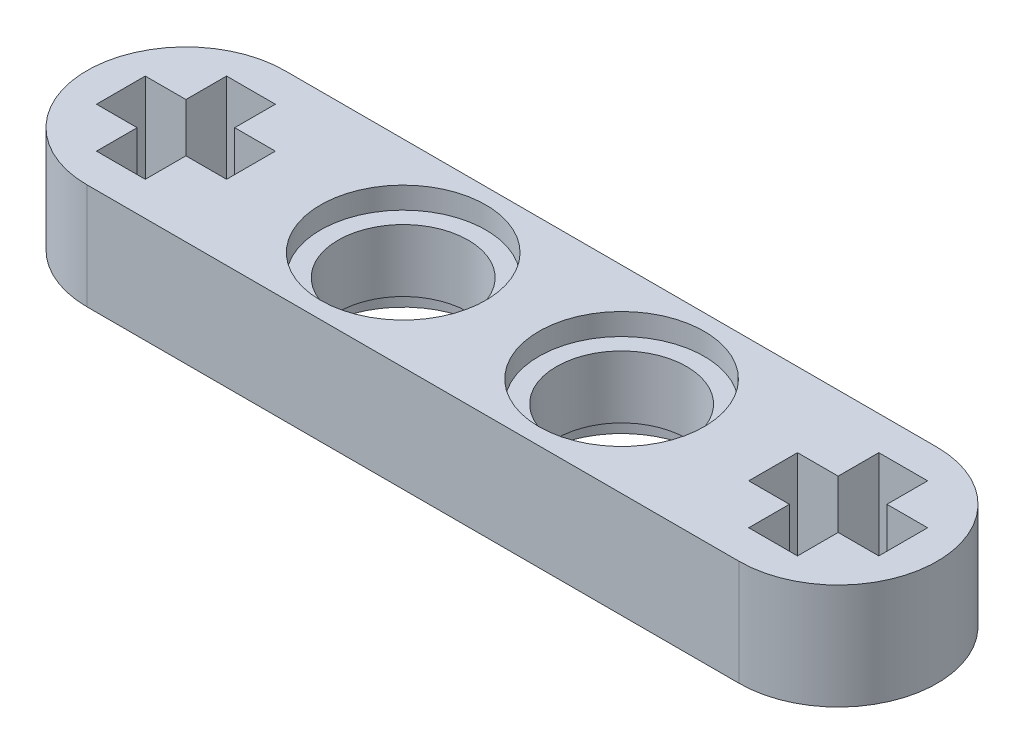
ISO-10303-21;
HEADER;
FILE_DESCRIPTION(('STEP AP214'),'2;1');
FILE_NAME('part.step','',(''),(''),'','','');
FILE_SCHEMA(('AUTOMOTIVE_DESIGN { 1 0 10303 214 1 1 1 1 }'));
ENDSEC;
DATA;
#1=APPLICATION_CONTEXT('core data for automotive mechanical design processes');
#2=APPLICATION_PROTOCOL_DEFINITION('international standard','automotive_design',2000,#1);
#3=PRODUCT_CONTEXT('',#1,'mechanical');
#4=PRODUCT('Part','Part','',(#3));
#5=PRODUCT_RELATED_PRODUCT_CATEGORY('part','',(#4));
#6=PRODUCT_DEFINITION_FORMATION('','',#4);
#7=PRODUCT_DEFINITION_CONTEXT('part definition',#1,'design');
#8=PRODUCT_DEFINITION('design','',#6,#7);
#9=PRODUCT_DEFINITION_SHAPE('','',#8);
#10=(LENGTH_UNIT() NAMED_UNIT(*) SI_UNIT(.MILLI.,.METRE.));
#11=(NAMED_UNIT(*) PLANE_ANGLE_UNIT() SI_UNIT($,.RADIAN.));
#12=(NAMED_UNIT(*) SI_UNIT($,.STERADIAN.) SOLID_ANGLE_UNIT());
#13=UNCERTAINTY_MEASURE_WITH_UNIT(LENGTH_MEASURE(1.E-05),#10,'distance_accuracy_value','');
#14=(GEOMETRIC_REPRESENTATION_CONTEXT(3) GLOBAL_UNCERTAINTY_ASSIGNED_CONTEXT((#13)) GLOBAL_UNIT_ASSIGNED_CONTEXT((#10,
#11,#12)) REPRESENTATION_CONTEXT('',''));
#15=CARTESIAN_POINT('',(0.,0.,0.));
#16=DIRECTION('',(0.,0.,1.));
#17=DIRECTION('',(1.,0.,0.));
#18=AXIS2_PLACEMENT_3D('',#15,#16,#17);
#19=CARTESIAN_POINT('',(-4.03306020227207,3.9,-0.018008221772184));
#20=DIRECTION('',(0.,-1.,0.));
#21=DIRECTION('',(0.,0.,-1.));
#22=AXIS2_PLACEMENT_3D('',#19,#20,#21);
#23=CYLINDRICAL_SURFACE('',#22,2.4);
#24=CARTESIAN_POINT('',(-4.03306020227207,3.1,-0.018008221772184));
#25=DIRECTION('',(0.,1.,0.));
#26=DIRECTION('',(0.,0.,1.));
#27=AXIS2_PLACEMENT_3D('',#24,#25,#26);
#28=CIRCLE('',#27,2.4);
#29=CARTESIAN_POINT('',(-4.03306020227207,3.1,2.38199177822782));
#30=VERTEX_POINT('',#29);
#31=EDGE_CURVE('E267',#30,#30,#28,.T.);
#32=ORIENTED_EDGE('',*,*,#31,.T.);
#33=EDGE_LOOP('',(#32));
#34=FACE_BOUND('',#33,.T.);
#35=CARTESIAN_POINT('',(-4.03306020227207,0.8,-0.018008221772184));
#36=DIRECTION('',(0.,-1.,0.));
#37=DIRECTION('',(0.,0.,-1.));
#38=AXIS2_PLACEMENT_3D('',#35,#36,#37);
#39=CIRCLE('',#38,2.4);
#40=CARTESIAN_POINT('',(-4.03306020227207,0.8,-2.41800822177218));
#41=VERTEX_POINT('',#40);
#42=EDGE_CURVE('E37',#41,#41,#39,.T.);
#43=ORIENTED_EDGE('',*,*,#42,.T.);
#44=EDGE_LOOP('',(#43));
#45=FACE_BOUND('',#44,.T.);
#46=ADVANCED_FACE('F33',(#34,#45),#23,.F.);
#47=CARTESIAN_POINT('',(4.035,3.9,-0.00827061217611126));
#48=DIRECTION('',(0.,-1.,0.));
#49=DIRECTION('',(0.,0.,-1.));
#50=AXIS2_PLACEMENT_3D('',#47,#48,#49);
#51=CYLINDRICAL_SURFACE('',#50,2.4);
#52=CARTESIAN_POINT('',(4.035,3.1,-0.00827061217611126));
#53=DIRECTION('',(0.,1.,0.));
#54=DIRECTION('',(0.,0.,1.));
#55=AXIS2_PLACEMENT_3D('',#52,#53,#54);
#56=CIRCLE('',#55,2.4);
#57=CARTESIAN_POINT('',(4.035,3.1,2.39172938782389));
#58=VERTEX_POINT('',#57);
#59=EDGE_CURVE('E429',#58,#58,#56,.T.);
#60=ORIENTED_EDGE('',*,*,#59,.T.);
#61=EDGE_LOOP('',(#60));
#62=FACE_BOUND('',#61,.T.);
#63=CARTESIAN_POINT('',(4.035,0.8,-0.00827061217611126));
#64=DIRECTION('',(0.,-1.,0.));
#65=DIRECTION('',(0.,0.,-1.));
#66=AXIS2_PLACEMENT_3D('',#63,#64,#65);
#67=CIRCLE('',#66,2.4);
#68=CARTESIAN_POINT('',(4.035,0.8,-2.40827061217611));
#69=VERTEX_POINT('',#68);
#70=EDGE_CURVE('E434',#69,#69,#67,.T.);
#71=ORIENTED_EDGE('',*,*,#70,.T.);
#72=EDGE_LOOP('',(#71));
#73=FACE_BOUND('',#72,.T.);
#74=ADVANCED_FACE('F469',(#62,#73),#51,.F.);
#75=CARTESIAN_POINT('',(-12.035,3.9,0.));
#76=DIRECTION('',(0.,1.,0.));
#77=DIRECTION('',(0.,0.,1.));
#78=AXIS2_PLACEMENT_3D('',#75,#76,#77);
#79=PLANE('',#78);
#80=CARTESIAN_POINT('',(4.035,3.9,-0.00827061217611126));
#81=DIRECTION('',(0.,1.,0.));
#82=DIRECTION('',(0.,0.,1.));
#83=AXIS2_PLACEMENT_3D('',#80,#81,#82);
#84=CIRCLE('',#83,3.05);
#85=CARTESIAN_POINT('',(4.035,3.9,3.04172938782389));
#86=VERTEX_POINT('',#85);
#87=EDGE_CURVE('E457',#86,#86,#84,.T.);
#88=ORIENTED_EDGE('',*,*,#87,.F.);
#89=EDGE_LOOP('',(#88));
#90=FACE_BOUND('',#89,.T.);
#91=CARTESIAN_POINT('',(-4.03306020227207,3.9,-0.018008221772184));
#92=DIRECTION('',(0.,1.,0.));
#93=DIRECTION('',(0.,0.,1.));
#94=AXIS2_PLACEMENT_3D('',#91,#92,#93);
#95=CIRCLE('',#94,3.05);
#96=CARTESIAN_POINT('',(-4.03306020227207,3.9,3.03199177822782));
#97=VERTEX_POINT('',#96);
#98=EDGE_CURVE('E440',#97,#97,#95,.T.);
#99=ORIENTED_EDGE('',*,*,#98,.F.);
#100=EDGE_LOOP('',(#99));
#101=FACE_BOUND('',#100,.T.);
#102=DIRECTION('',(1.,0.,0.));
#103=VECTOR('',#102,1.);
#104=CARTESIAN_POINT('',(-9.63306020227232,3.9,0.898912155858764));
#105=LINE('',#104,#103);
#106=CARTESIAN_POINT('',(-11.1330602022721,3.9,0.898912155858764));
#107=VERTEX_POINT('',#106);
#108=CARTESIAN_POINT('',(-9.63306020227232,3.9,0.898912155858764));
#109=VERTEX_POINT('',#108);
#110=EDGE_CURVE('E228',#107,#109,#105,.T.);
#111=ORIENTED_EDGE('',*,*,#110,.F.);
#112=DIRECTION('',(0.,0.,-1.));
#113=VECTOR('',#112,1.);
#114=CARTESIAN_POINT('',(-11.1330602022721,3.9,0.898912155858764));
#115=LINE('',#114,#113);
#116=CARTESIAN_POINT('',(-11.1330602022721,3.9,2.39891215586455));
#117=VERTEX_POINT('',#116);
#118=EDGE_CURVE('E220',#117,#107,#115,.T.);
#119=ORIENTED_EDGE('',*,*,#118,.F.);
#120=DIRECTION('',(1.,0.,0.));
#121=VECTOR('',#120,1.);
#122=CARTESIAN_POINT('',(-12.9330602022723,3.9,2.39891215586455));
#123=LINE('',#122,#121);
#124=CARTESIAN_POINT('',(-12.9330602022723,3.9,2.39891215586455));
#125=VERTEX_POINT('',#124);
#126=EDGE_CURVE('E264',#125,#117,#123,.T.);
#127=ORIENTED_EDGE('',*,*,#126,.F.);
#128=DIRECTION('',(0.,0.,1.));
#129=VECTOR('',#128,1.);
#130=CARTESIAN_POINT('',(-12.9330602022723,3.9,0.898912155858764));
#131=LINE('',#130,#129);
#132=CARTESIAN_POINT('',(-12.9330602022723,3.9,0.898912155858764));
#133=VERTEX_POINT('',#132);
#134=EDGE_CURVE('E262',#133,#125,#131,.T.);
#135=ORIENTED_EDGE('',*,*,#134,.F.);
#136=DIRECTION('',(1.,0.,0.));
#137=VECTOR('',#136,1.);
#138=CARTESIAN_POINT('',(-12.9330602022723,3.9,0.898912155858764));
#139=LINE('',#138,#137);
#140=CARTESIAN_POINT('',(-14.4330602022723,3.9,0.898912155858765));
#141=VERTEX_POINT('',#140);
#142=EDGE_CURVE('E260',#141,#133,#139,.T.);
#143=ORIENTED_EDGE('',*,*,#142,.F.);
#144=DIRECTION('',(0.,0.,1.));
#145=VECTOR('',#144,1.);
#146=CARTESIAN_POINT('',(-14.4330602022723,3.9,0.898912155858765));
#147=LINE('',#146,#145);
#148=CARTESIAN_POINT('',(-14.4330602022723,3.9,-0.901087844141502));
#149=VERTEX_POINT('',#148);
#150=EDGE_CURVE('E258',#149,#141,#147,.T.);
#151=ORIENTED_EDGE('',*,*,#150,.F.);
#152=DIRECTION('',(-1.,0.,0.));
#153=VECTOR('',#152,1.);
#154=CARTESIAN_POINT('',(-12.9330602022723,3.9,-0.901087844141502));
#155=LINE('',#154,#153);
#156=CARTESIAN_POINT('',(-12.9330602022723,3.9,-0.901087844141502));
#157=VERTEX_POINT('',#156);
#158=EDGE_CURVE('E256',#157,#149,#155,.T.);
#159=ORIENTED_EDGE('',*,*,#158,.F.);
#160=DIRECTION('',(0.,0.,1.));
#161=VECTOR('',#160,1.);
#162=CARTESIAN_POINT('',(-12.9330602022723,3.9,-2.40108784413312));
#163=LINE('',#162,#161);
#164=CARTESIAN_POINT('',(-12.9330602022723,3.9,-2.40108784413312));
#165=VERTEX_POINT('',#164);
#166=EDGE_CURVE('E254',#165,#157,#163,.T.);
#167=ORIENTED_EDGE('',*,*,#166,.F.);
#168=DIRECTION('',(-1.,0.,0.));
#169=VECTOR('',#168,1.);
#170=CARTESIAN_POINT('',(-12.9330602022723,3.9,-2.40108784413312));
#171=LINE('',#170,#169);
#172=CARTESIAN_POINT('',(-11.1330602022721,3.9,-2.40108784413312));
#173=VERTEX_POINT('',#172);
#174=EDGE_CURVE('E252',#173,#165,#171,.T.);
#175=ORIENTED_EDGE('',*,*,#174,.F.);
#176=DIRECTION('',(0.,0.,-1.));
#177=VECTOR('',#176,1.);
#178=CARTESIAN_POINT('',(-11.1330602022721,3.9,-2.40108784413312));
#179=LINE('',#178,#177);
#180=CARTESIAN_POINT('',(-11.1330602022721,3.9,-0.901087844141486));
#181=VERTEX_POINT('',#180);
#182=EDGE_CURVE('E250',#181,#173,#179,.T.);
#183=ORIENTED_EDGE('',*,*,#182,.F.);
#184=DIRECTION('',(-1.,0.,0.));
#185=VECTOR('',#184,1.);
#186=CARTESIAN_POINT('',(-9.63306020227232,3.9,-0.901087844141502));
#187=LINE('',#186,#185);
#188=CARTESIAN_POINT('',(-9.63306020227232,3.9,-0.901087844141502));
#189=VERTEX_POINT('',#188);
#190=EDGE_CURVE('E245',#189,#181,#187,.T.);
#191=ORIENTED_EDGE('',*,*,#190,.F.);
#192=DIRECTION('',(0.,0.,-1.));
#193=VECTOR('',#192,1.);
#194=CARTESIAN_POINT('',(-9.63306020227232,3.9,0.898912155858764));
#195=LINE('',#194,#193);
#196=EDGE_CURVE('E243',#109,#189,#195,.T.);
#197=ORIENTED_EDGE('',*,*,#196,.F.);
#198=EDGE_LOOP('',(#111,#119,#127,#135,#143,#151,#159,#167,#175,#183,#191,#197));
#199=FACE_BOUND('',#198,.T.);
#200=DIRECTION('',(1.,0.,0.));
#201=VECTOR('',#200,1.);
#202=CARTESIAN_POINT('',(14.435,3.9,0.9));
#203=LINE('',#202,#201);
#204=CARTESIAN_POINT('',(12.935,3.9,0.9));
#205=VERTEX_POINT('',#204);
#206=CARTESIAN_POINT('',(14.435,3.9,0.9));
#207=VERTEX_POINT('',#206);
#208=EDGE_CURVE('E319',#205,#207,#203,.T.);
#209=ORIENTED_EDGE('',*,*,#208,.F.);
#210=DIRECTION('',(0.,0.,-1.));
#211=VECTOR('',#210,1.);
#212=CARTESIAN_POINT('',(12.935,3.9,0.9));
#213=LINE('',#212,#211);
#214=CARTESIAN_POINT('',(12.935,3.9,2.4));
#215=VERTEX_POINT('',#214);
#216=EDGE_CURVE('E317',#215,#205,#213,.T.);
#217=ORIENTED_EDGE('',*,*,#216,.F.);
#218=DIRECTION('',(1.,0.,0.));
#219=VECTOR('',#218,1.);
#220=CARTESIAN_POINT('',(11.135,3.9,2.4));
#221=LINE('',#220,#219);
#222=CARTESIAN_POINT('',(11.135,3.9,2.4));
#223=VERTEX_POINT('',#222);
#224=EDGE_CURVE('E341',#223,#215,#221,.T.);
#225=ORIENTED_EDGE('',*,*,#224,.F.);
#226=DIRECTION('',(0.,0.,1.));
#227=VECTOR('',#226,1.);
#228=CARTESIAN_POINT('',(11.135,3.9,0.9));
#229=LINE('',#228,#227);
#230=CARTESIAN_POINT('',(11.135,3.9,0.9));
#231=VERTEX_POINT('',#230);
#232=EDGE_CURVE('E338',#231,#223,#229,.T.);
#233=ORIENTED_EDGE('',*,*,#232,.F.);
#234=DIRECTION('',(1.,0.,0.));
#235=VECTOR('',#234,1.);
#236=CARTESIAN_POINT('',(11.135,3.9,0.9));
#237=LINE('',#236,#235);
#238=CARTESIAN_POINT('',(9.63499999999998,3.9,0.900000000000001));
#239=VERTEX_POINT('',#238);
#240=EDGE_CURVE('E336',#239,#231,#237,.T.);
#241=ORIENTED_EDGE('',*,*,#240,.F.);
#242=DIRECTION('',(0.,0.,1.));
#243=VECTOR('',#242,1.);
#244=CARTESIAN_POINT('',(9.63499999999998,3.9,0.900000000000001));
#245=LINE('',#244,#243);
#246=CARTESIAN_POINT('',(9.63500000000002,3.9,-0.9));
#247=VERTEX_POINT('',#246);
#248=EDGE_CURVE('E334',#247,#239,#245,.T.);
#249=ORIENTED_EDGE('',*,*,#248,.F.);
#250=DIRECTION('',(-1.,0.,0.));
#251=VECTOR('',#250,1.);
#252=CARTESIAN_POINT('',(11.135,3.9,-0.900000000000001));
#253=LINE('',#252,#251);
#254=CARTESIAN_POINT('',(11.135,3.9,-0.900000000000001));
#255=VERTEX_POINT('',#254);
#256=EDGE_CURVE('E332',#255,#247,#253,.T.);
#257=ORIENTED_EDGE('',*,*,#256,.F.);
#258=DIRECTION('',(0.,0.,1.));
#259=VECTOR('',#258,1.);
#260=CARTESIAN_POINT('',(11.135,3.9,-2.4));
#261=LINE('',#260,#259);
#262=CARTESIAN_POINT('',(11.135,3.9,-2.4));
#263=VERTEX_POINT('',#262);
#264=EDGE_CURVE('E330',#263,#255,#261,.T.);
#265=ORIENTED_EDGE('',*,*,#264,.F.);
#266=DIRECTION('',(-1.,0.,0.));
#267=VECTOR('',#266,1.);
#268=CARTESIAN_POINT('',(11.135,3.9,-2.4));
#269=LINE('',#268,#267);
#270=CARTESIAN_POINT('',(12.935,3.9,-2.4));
#271=VERTEX_POINT('',#270);
#272=EDGE_CURVE('E328',#271,#263,#269,.T.);
#273=ORIENTED_EDGE('',*,*,#272,.F.);
#274=DIRECTION('',(0.,0.,-1.));
#275=VECTOR('',#274,1.);
#276=CARTESIAN_POINT('',(12.935,3.9,-2.4));
#277=LINE('',#276,#275);
#278=CARTESIAN_POINT('',(12.935,3.9,-0.900000000000002));
#279=VERTEX_POINT('',#278);
#280=EDGE_CURVE('E326',#279,#271,#277,.T.);
#281=ORIENTED_EDGE('',*,*,#280,.F.);
#282=DIRECTION('',(-1.,0.,0.));
#283=VECTOR('',#282,1.);
#284=CARTESIAN_POINT('',(14.435,3.9,-0.900000000000003));
#285=LINE('',#284,#283);
#286=CARTESIAN_POINT('',(14.435,3.9,-0.900000000000003));
#287=VERTEX_POINT('',#286);
#288=EDGE_CURVE('E324',#287,#279,#285,.T.);
#289=ORIENTED_EDGE('',*,*,#288,.F.);
#290=DIRECTION('',(0.,0.,-1.));
#291=VECTOR('',#290,1.);
#292=CARTESIAN_POINT('',(14.435,3.9,0.9));
#293=LINE('',#292,#291);
#294=EDGE_CURVE('E322',#207,#287,#293,.T.);
#295=ORIENTED_EDGE('',*,*,#294,.F.);
#296=EDGE_LOOP('',(#209,#217,#225,#233,#241,#249,#257,#265,#273,#281,#289,#295));
#297=FACE_BOUND('',#296,.T.);
#298=CARTESIAN_POINT('',(-12.035,3.9,0.));
#299=DIRECTION('',(0.,1.,0.));
#300=DIRECTION('',(0.,0.,1.));
#301=AXIS2_PLACEMENT_3D('',#298,#299,#300);
#302=CIRCLE('',#301,3.65);
#303=CARTESIAN_POINT('',(-12.035,3.9,-3.65));
#304=VERTEX_POINT('',#303);
#305=CARTESIAN_POINT('',(-12.035,3.9,3.65));
#306=VERTEX_POINT('',#305);
#307=EDGE_CURVE('E404',#304,#306,#302,.T.);
#308=ORIENTED_EDGE('',*,*,#307,.T.);
#309=DIRECTION('',(1.,0.,0.));
#310=VECTOR('',#309,1.);
#311=CARTESIAN_POINT('',(-12.035,3.9,3.65));
#312=LINE('',#311,#310);
#313=CARTESIAN_POINT('',(12.035,3.9,3.65));
#314=VERTEX_POINT('',#313);
#315=EDGE_CURVE('E407',#306,#314,#312,.T.);
#316=ORIENTED_EDGE('',*,*,#315,.T.);
#317=CARTESIAN_POINT('',(12.035,3.9,0.));
#318=DIRECTION('',(0.,1.,0.));
#319=DIRECTION('',(0.,0.,1.));
#320=AXIS2_PLACEMENT_3D('',#317,#318,#319);
#321=CIRCLE('',#320,3.65);
#322=CARTESIAN_POINT('',(12.035,3.9,-3.65));
#323=VERTEX_POINT('',#322);
#324=EDGE_CURVE('E410',#314,#323,#321,.T.);
#325=ORIENTED_EDGE('',*,*,#324,.T.);
#326=DIRECTION('',(-1.,0.,0.));
#327=VECTOR('',#326,1.);
#328=CARTESIAN_POINT('',(-12.035,3.9,-3.65));
#329=LINE('',#328,#327);
#330=EDGE_CURVE('E412',#323,#304,#329,.T.);
#331=ORIENTED_EDGE('',*,*,#330,.T.);
#332=EDGE_LOOP('',(#308,#316,#325,#331));
#333=FACE_BOUND('',#332,.T.);
#334=ADVANCED_FACE('F240',(#90,#101,#199,#297,#333),#79,.T.);
#335=CARTESIAN_POINT('',(-12.035,0.,0.));
#336=DIRECTION('',(0.,1.,0.));
#337=DIRECTION('',(0.,0.,1.));
#338=AXIS2_PLACEMENT_3D('',#335,#336,#337);
#339=PLANE('',#338);
#340=CARTESIAN_POINT('',(-4.03306020227207,0.,-0.018008221772184));
#341=DIRECTION('',(0.,-1.,0.));
#342=DIRECTION('',(0.,0.,-1.));
#343=AXIS2_PLACEMENT_3D('',#340,#341,#342);
#344=CIRCLE('',#343,3.05);
#345=CARTESIAN_POINT('',(-4.03306020227207,0.,-3.06800822177218));
#346=VERTEX_POINT('',#345);
#347=EDGE_CURVE('E442',#346,#346,#344,.T.);
#348=ORIENTED_EDGE('',*,*,#347,.F.);
#349=EDGE_LOOP('',(#348));
#350=FACE_BOUND('',#349,.T.);
#351=CARTESIAN_POINT('',(4.035,0.,-0.00827061217611126));
#352=DIRECTION('',(0.,-1.,0.));
#353=DIRECTION('',(0.,0.,-1.));
#354=AXIS2_PLACEMENT_3D('',#351,#352,#353);
#355=CIRCLE('',#354,3.05);
#356=CARTESIAN_POINT('',(4.035,0.,-3.05827061217611));
#357=VERTEX_POINT('',#356);
#358=EDGE_CURVE('E452',#357,#357,#355,.T.);
#359=ORIENTED_EDGE('',*,*,#358,.F.);
#360=EDGE_LOOP('',(#359));
#361=FACE_BOUND('',#360,.T.);
#362=DIRECTION('',(0.,0.,-1.));
#363=VECTOR('',#362,1.);
#364=CARTESIAN_POINT('',(12.935,0.,0.9));
#365=LINE('',#364,#363);
#366=CARTESIAN_POINT('',(12.935,0.,2.4));
#367=VERTEX_POINT('',#366);
#368=CARTESIAN_POINT('',(12.935,0.,0.9));
#369=VERTEX_POINT('',#368);
#370=EDGE_CURVE('E236',#367,#369,#365,.T.);
#371=ORIENTED_EDGE('',*,*,#370,.T.);
#372=DIRECTION('',(1.,0.,0.));
#373=VECTOR('',#372,1.);
#374=CARTESIAN_POINT('',(14.435,0.,0.9));
#375=LINE('',#374,#373);
#376=CARTESIAN_POINT('',(14.435,0.,0.9));
#377=VERTEX_POINT('',#376);
#378=EDGE_CURVE('E346',#369,#377,#375,.T.);
#379=ORIENTED_EDGE('',*,*,#378,.T.);
#380=DIRECTION('',(0.,0.,-1.));
#381=VECTOR('',#380,1.);
#382=CARTESIAN_POINT('',(14.435,0.,0.9));
#383=LINE('',#382,#381);
#384=CARTESIAN_POINT('',(14.435,0.,-0.900000000000003));
#385=VERTEX_POINT('',#384);
#386=EDGE_CURVE('E349',#377,#385,#383,.T.);
#387=ORIENTED_EDGE('',*,*,#386,.T.);
#388=DIRECTION('',(-1.,0.,0.));
#389=VECTOR('',#388,1.);
#390=CARTESIAN_POINT('',(14.435,0.,-0.900000000000003));
#391=LINE('',#390,#389);
#392=CARTESIAN_POINT('',(12.935,0.,-0.900000000000002));
#393=VERTEX_POINT('',#392);
#394=EDGE_CURVE('E352',#385,#393,#391,.T.);
#395=ORIENTED_EDGE('',*,*,#394,.T.);
#396=DIRECTION('',(0.,0.,-1.));
#397=VECTOR('',#396,1.);
#398=CARTESIAN_POINT('',(12.935,0.,-2.4));
#399=LINE('',#398,#397);
#400=CARTESIAN_POINT('',(12.935,0.,-2.4));
#401=VERTEX_POINT('',#400);
#402=EDGE_CURVE('E355',#393,#401,#399,.T.);
#403=ORIENTED_EDGE('',*,*,#402,.T.);
#404=DIRECTION('',(-1.,0.,0.));
#405=VECTOR('',#404,1.);
#406=CARTESIAN_POINT('',(11.135,0.,-2.4));
#407=LINE('',#406,#405);
#408=CARTESIAN_POINT('',(11.135,0.,-2.4));
#409=VERTEX_POINT('',#408);
#410=EDGE_CURVE('E358',#401,#409,#407,.T.);
#411=ORIENTED_EDGE('',*,*,#410,.T.);
#412=DIRECTION('',(0.,0.,1.));
#413=VECTOR('',#412,1.);
#414=CARTESIAN_POINT('',(11.135,0.,-2.4));
#415=LINE('',#414,#413);
#416=CARTESIAN_POINT('',(11.135,0.,-0.900000000000001));
#417=VERTEX_POINT('',#416);
#418=EDGE_CURVE('E361',#409,#417,#415,.T.);
#419=ORIENTED_EDGE('',*,*,#418,.T.);
#420=DIRECTION('',(-1.,0.,0.));
#421=VECTOR('',#420,1.);
#422=CARTESIAN_POINT('',(11.135,0.,-0.900000000000001));
#423=LINE('',#422,#421);
#424=CARTESIAN_POINT('',(9.63500000000002,0.,-0.9));
#425=VERTEX_POINT('',#424);
#426=EDGE_CURVE('E364',#417,#425,#423,.T.);
#427=ORIENTED_EDGE('',*,*,#426,.T.);
#428=DIRECTION('',(0.,0.,1.));
#429=VECTOR('',#428,1.);
#430=CARTESIAN_POINT('',(9.63499999999998,0.,0.900000000000001));
#431=LINE('',#430,#429);
#432=CARTESIAN_POINT('',(9.63499999999998,0.,0.900000000000001));
#433=VERTEX_POINT('',#432);
#434=EDGE_CURVE('E367',#425,#433,#431,.T.);
#435=ORIENTED_EDGE('',*,*,#434,.T.);
#436=DIRECTION('',(1.,0.,0.));
#437=VECTOR('',#436,1.);
#438=CARTESIAN_POINT('',(11.135,0.,0.9));
#439=LINE('',#438,#437);
#440=CARTESIAN_POINT('',(11.135,0.,0.9));
#441=VERTEX_POINT('',#440);
#442=EDGE_CURVE('E370',#433,#441,#439,.T.);
#443=ORIENTED_EDGE('',*,*,#442,.T.);
#444=DIRECTION('',(0.,0.,1.));
#445=VECTOR('',#444,1.);
#446=CARTESIAN_POINT('',(11.135,0.,0.9));
#447=LINE('',#446,#445);
#448=CARTESIAN_POINT('',(11.135,0.,2.4));
#449=VERTEX_POINT('',#448);
#450=EDGE_CURVE('E373',#441,#449,#447,.T.);
#451=ORIENTED_EDGE('',*,*,#450,.T.);
#452=DIRECTION('',(1.,0.,0.));
#453=VECTOR('',#452,1.);
#454=CARTESIAN_POINT('',(11.135,0.,2.4));
#455=LINE('',#454,#453);
#456=EDGE_CURVE('E320',#449,#367,#455,.T.);
#457=ORIENTED_EDGE('',*,*,#456,.T.);
#458=EDGE_LOOP('',(#371,#379,#387,#395,#403,#411,#419,#427,#435,#443,#451,#457));
#459=FACE_BOUND('',#458,.T.);
#460=CARTESIAN_POINT('',(-12.035,0.,0.));
#461=DIRECTION('',(0.,1.,0.));
#462=DIRECTION('',(0.,0.,1.));
#463=AXIS2_PLACEMENT_3D('',#460,#461,#462);
#464=CIRCLE('',#463,3.65);
#465=CARTESIAN_POINT('',(-12.035,0.,-3.65));
#466=VERTEX_POINT('',#465);
#467=CARTESIAN_POINT('',(-12.035,0.,3.65));
#468=VERTEX_POINT('',#467);
#469=EDGE_CURVE('E403',#466,#468,#464,.T.);
#470=ORIENTED_EDGE('',*,*,#469,.F.);
#471=DIRECTION('',(-1.,0.,0.));
#472=VECTOR('',#471,1.);
#473=CARTESIAN_POINT('',(-12.035,0.,-3.65));
#474=LINE('',#473,#472);
#475=CARTESIAN_POINT('',(12.035,0.,-3.65));
#476=VERTEX_POINT('',#475);
#477=EDGE_CURVE('E408',#476,#466,#474,.T.);
#478=ORIENTED_EDGE('',*,*,#477,.F.);
#479=CARTESIAN_POINT('',(12.035,0.,0.));
#480=DIRECTION('',(0.,1.,0.));
#481=DIRECTION('',(0.,0.,1.));
#482=AXIS2_PLACEMENT_3D('',#479,#480,#481);
#483=CIRCLE('',#482,3.65);
#484=CARTESIAN_POINT('',(12.035,0.,3.65));
#485=VERTEX_POINT('',#484);
#486=EDGE_CURVE('E419',#485,#476,#483,.T.);
#487=ORIENTED_EDGE('',*,*,#486,.F.);
#488=DIRECTION('',(1.,0.,0.));
#489=VECTOR('',#488,1.);
#490=CARTESIAN_POINT('',(-12.035,0.,3.65));
#491=LINE('',#490,#489);
#492=EDGE_CURVE('E417',#468,#485,#491,.T.);
#493=ORIENTED_EDGE('',*,*,#492,.F.);
#494=EDGE_LOOP('',(#470,#478,#487,#493));
#495=FACE_BOUND('',#494,.T.);
#496=DIRECTION('',(0.,0.,-1.));
#497=VECTOR('',#496,1.);
#498=CARTESIAN_POINT('',(-11.1330602022721,0.,0.898912155858764));
#499=LINE('',#498,#497);
#500=CARTESIAN_POINT('',(-11.1330602022721,0.,2.39891215586455));
#501=VERTEX_POINT('',#500);
#502=CARTESIAN_POINT('',(-11.1330602022721,0.,0.898912155858764));
#503=VERTEX_POINT('',#502);
#504=EDGE_CURVE('E58',#501,#503,#499,.T.);
#505=ORIENTED_EDGE('',*,*,#504,.T.);
#506=DIRECTION('',(1.,0.,0.));
#507=VECTOR('',#506,1.);
#508=CARTESIAN_POINT('',(-9.63306020227232,0.,0.898912155858764));
#509=LINE('',#508,#507);
#510=CARTESIAN_POINT('',(-9.63306020227232,0.,0.898912155858764));
#511=VERTEX_POINT('',#510);
#512=EDGE_CURVE('E235',#503,#511,#509,.T.);
#513=ORIENTED_EDGE('',*,*,#512,.T.);
#514=DIRECTION('',(0.,0.,-1.));
#515=VECTOR('',#514,1.);
#516=CARTESIAN_POINT('',(-9.63306020227232,0.,0.898912155858764));
#517=LINE('',#516,#515);
#518=CARTESIAN_POINT('',(-9.63306020227232,0.,-0.901087844141502));
#519=VERTEX_POINT('',#518);
#520=EDGE_CURVE('E269',#511,#519,#517,.T.);
#521=ORIENTED_EDGE('',*,*,#520,.T.);
#522=DIRECTION('',(-1.,0.,0.));
#523=VECTOR('',#522,1.);
#524=CARTESIAN_POINT('',(-9.63306020227232,0.,-0.901087844141502));
#525=LINE('',#524,#523);
#526=CARTESIAN_POINT('',(-11.1330602022721,0.,-0.901087844141486));
#527=VERTEX_POINT('',#526);
#528=EDGE_CURVE('E272',#519,#527,#525,.T.);
#529=ORIENTED_EDGE('',*,*,#528,.T.);
#530=DIRECTION('',(0.,0.,-1.));
#531=VECTOR('',#530,1.);
#532=CARTESIAN_POINT('',(-11.1330602022721,0.,-2.40108784413312));
#533=LINE('',#532,#531);
#534=CARTESIAN_POINT('',(-11.1330602022721,0.,-2.40108784413312));
#535=VERTEX_POINT('',#534);
#536=EDGE_CURVE('E275',#527,#535,#533,.T.);
#537=ORIENTED_EDGE('',*,*,#536,.T.);
#538=DIRECTION('',(-1.,0.,0.));
#539=VECTOR('',#538,1.);
#540=CARTESIAN_POINT('',(-12.9330602022723,0.,-2.40108784413312));
#541=LINE('',#540,#539);
#542=CARTESIAN_POINT('',(-12.9330602022723,0.,-2.40108784413312));
#543=VERTEX_POINT('',#542);
#544=EDGE_CURVE('E278',#535,#543,#541,.T.);
#545=ORIENTED_EDGE('',*,*,#544,.T.);
#546=DIRECTION('',(0.,0.,1.));
#547=VECTOR('',#546,1.);
#548=CARTESIAN_POINT('',(-12.9330602022723,0.,-2.40108784413312));
#549=LINE('',#548,#547);
#550=CARTESIAN_POINT('',(-12.9330602022723,0.,-0.901087844141502));
#551=VERTEX_POINT('',#550);
#552=EDGE_CURVE('E281',#543,#551,#549,.T.);
#553=ORIENTED_EDGE('',*,*,#552,.T.);
#554=DIRECTION('',(-1.,0.,0.));
#555=VECTOR('',#554,1.);
#556=CARTESIAN_POINT('',(-12.9330602022723,0.,-0.901087844141502));
#557=LINE('',#556,#555);
#558=CARTESIAN_POINT('',(-14.4330602022723,0.,-0.901087844141502));
#559=VERTEX_POINT('',#558);
#560=EDGE_CURVE('E284',#551,#559,#557,.T.);
#561=ORIENTED_EDGE('',*,*,#560,.T.);
#562=DIRECTION('',(0.,0.,1.));
#563=VECTOR('',#562,1.);
#564=CARTESIAN_POINT('',(-14.4330602022723,0.,0.898912155858765));
#565=LINE('',#564,#563);
#566=CARTESIAN_POINT('',(-14.4330602022723,0.,0.898912155858765));
#567=VERTEX_POINT('',#566);
#568=EDGE_CURVE('E287',#559,#567,#565,.T.);
#569=ORIENTED_EDGE('',*,*,#568,.T.);
#570=DIRECTION('',(1.,0.,0.));
#571=VECTOR('',#570,1.);
#572=CARTESIAN_POINT('',(-12.9330602022723,0.,0.898912155858764));
#573=LINE('',#572,#571);
#574=CARTESIAN_POINT('',(-12.9330602022723,0.,0.898912155858764));
#575=VERTEX_POINT('',#574);
#576=EDGE_CURVE('E290',#567,#575,#573,.T.);
#577=ORIENTED_EDGE('',*,*,#576,.T.);
#578=DIRECTION('',(0.,0.,1.));
#579=VECTOR('',#578,1.);
#580=CARTESIAN_POINT('',(-12.9330602022723,0.,0.898912155858764));
#581=LINE('',#580,#579);
#582=CARTESIAN_POINT('',(-12.9330602022723,0.,2.39891215586455));
#583=VERTEX_POINT('',#582);
#584=EDGE_CURVE('E293',#575,#583,#581,.T.);
#585=ORIENTED_EDGE('',*,*,#584,.T.);
#586=DIRECTION('',(1.,0.,0.));
#587=VECTOR('',#586,1.);
#588=CARTESIAN_POINT('',(-12.9330602022723,0.,2.39891215586455));
#589=LINE('',#588,#587);
#590=EDGE_CURVE('E229',#583,#501,#589,.T.);
#591=ORIENTED_EDGE('',*,*,#590,.T.);
#592=EDGE_LOOP('',(#505,#513,#521,#529,#537,#545,#553,#561,#569,#577,#585,#591));
#593=FACE_BOUND('',#592,.T.);
#594=ADVANCED_FACE('F468',(#350,#361,#459,#495,#593),#339,.F.);
#595=CARTESIAN_POINT('',(-12.035,3.9,0.));
#596=DIRECTION('',(0.,-1.,0.));
#597=DIRECTION('',(0.,0.,-1.));
#598=AXIS2_PLACEMENT_3D('',#595,#596,#597);
#599=CYLINDRICAL_SURFACE('',#598,3.65);
#600=ORIENTED_EDGE('',*,*,#469,.T.);
#601=DIRECTION('',(0.,-1.,0.));
#602=VECTOR('',#601,1.);
#603=CARTESIAN_POINT('',(-12.035,3.9,3.65));
#604=LINE('',#603,#602);
#605=EDGE_CURVE('E11',#306,#468,#604,.T.);
#606=ORIENTED_EDGE('',*,*,#605,.F.);
#607=ORIENTED_EDGE('',*,*,#307,.F.);
#608=DIRECTION('',(0.,-1.,0.));
#609=VECTOR('',#608,1.);
#610=CARTESIAN_POINT('',(-12.035,3.9,-3.65));
#611=LINE('',#610,#609);
#612=EDGE_CURVE('E414',#304,#466,#611,.T.);
#613=ORIENTED_EDGE('',*,*,#612,.T.);
#614=EDGE_LOOP('',(#600,#606,#607,#613));
#615=FACE_BOUND('',#614,.T.);
#616=ADVANCED_FACE('F35',(#615),#599,.T.);
#617=CARTESIAN_POINT('',(-12.035,3.9,3.65));
#618=DIRECTION('',(0.,0.,-1.));
#619=DIRECTION('',(-1.,0.,0.));
#620=AXIS2_PLACEMENT_3D('',#617,#618,#619);
#621=PLANE('',#620);
#622=ORIENTED_EDGE('',*,*,#492,.T.);
#623=DIRECTION('',(0.,-1.,0.));
#624=VECTOR('',#623,1.);
#625=CARTESIAN_POINT('',(12.035,3.9,3.65));
#626=LINE('',#625,#624);
#627=EDGE_CURVE('E42',#314,#485,#626,.T.);
#628=ORIENTED_EDGE('',*,*,#627,.F.);
#629=ORIENTED_EDGE('',*,*,#315,.F.);
#630=ORIENTED_EDGE('',*,*,#605,.T.);
#631=EDGE_LOOP('',(#622,#628,#629,#630));
#632=FACE_BOUND('',#631,.T.);
#633=ADVANCED_FACE('F761',(#632),#621,.F.);
#634=CARTESIAN_POINT('',(12.035,3.9,0.));
#635=DIRECTION('',(0.,-1.,0.));
#636=DIRECTION('',(0.,0.,-1.));
#637=AXIS2_PLACEMENT_3D('',#634,#635,#636);
#638=CYLINDRICAL_SURFACE('',#637,3.65);
#639=ORIENTED_EDGE('',*,*,#486,.T.);
#640=DIRECTION('',(0.,-1.,0.));
#641=VECTOR('',#640,1.);
#642=CARTESIAN_POINT('',(12.035,3.9,-3.65));
#643=LINE('',#642,#641);
#644=EDGE_CURVE('E424',#323,#476,#643,.T.);
#645=ORIENTED_EDGE('',*,*,#644,.F.);
#646=ORIENTED_EDGE('',*,*,#324,.F.);
#647=ORIENTED_EDGE('',*,*,#627,.T.);
#648=EDGE_LOOP('',(#639,#645,#646,#647));
#649=FACE_BOUND('',#648,.T.);
#650=ADVANCED_FACE('F753',(#649),#638,.T.);
#651=CARTESIAN_POINT('',(-12.035,3.9,-3.65));
#652=DIRECTION('',(0.,0.,1.));
#653=DIRECTION('',(1.,0.,0.));
#654=AXIS2_PLACEMENT_3D('',#651,#652,#653);
#655=PLANE('',#654);
#656=ORIENTED_EDGE('',*,*,#477,.T.);
#657=ORIENTED_EDGE('',*,*,#612,.F.);
#658=ORIENTED_EDGE('',*,*,#330,.F.);
#659=ORIENTED_EDGE('',*,*,#644,.T.);
#660=EDGE_LOOP('',(#656,#657,#658,#659));
#661=FACE_BOUND('',#660,.T.);
#662=ADVANCED_FACE('F495',(#661),#655,.F.);
#663=CARTESIAN_POINT('',(12.935,3.9,0.9));
#664=DIRECTION('',(-1.,0.,0.));
#665=DIRECTION('',(0.,0.,1.));
#666=AXIS2_PLACEMENT_3D('',#663,#664,#665);
#667=PLANE('',#666);
#668=ORIENTED_EDGE('',*,*,#370,.F.);
#669=DIRECTION('',(0.,-1.,0.));
#670=VECTOR('',#669,1.);
#671=CARTESIAN_POINT('',(12.935,3.9,2.4));
#672=LINE('',#671,#670);
#673=EDGE_CURVE('E343',#215,#367,#672,.T.);
#674=ORIENTED_EDGE('',*,*,#673,.F.);
#675=ORIENTED_EDGE('',*,*,#216,.T.);
#676=DIRECTION('',(0.,-1.,0.));
#677=VECTOR('',#676,1.);
#678=CARTESIAN_POINT('',(12.935,3.9,0.9));
#679=LINE('',#678,#677);
#680=EDGE_CURVE('E400',#205,#369,#679,.T.);
#681=ORIENTED_EDGE('',*,*,#680,.T.);
#682=EDGE_LOOP('',(#668,#674,#675,#681));
#683=FACE_BOUND('',#682,.T.);
#684=ADVANCED_FACE('F491',(#683),#667,.T.);
#685=CARTESIAN_POINT('',(14.435,3.9,0.9));
#686=DIRECTION('',(0.,0.,-1.));
#687=DIRECTION('',(-1.,0.,0.));
#688=AXIS2_PLACEMENT_3D('',#685,#686,#687);
#689=PLANE('',#688);
#690=ORIENTED_EDGE('',*,*,#378,.F.);
#691=ORIENTED_EDGE('',*,*,#680,.F.);
#692=ORIENTED_EDGE('',*,*,#208,.T.);
#693=DIRECTION('',(0.,-1.,0.));
#694=VECTOR('',#693,1.);
#695=CARTESIAN_POINT('',(14.435,3.9,0.9));
#696=LINE('',#695,#694);
#697=EDGE_CURVE('E398',#207,#377,#696,.T.);
#698=ORIENTED_EDGE('',*,*,#697,.T.);
#699=EDGE_LOOP('',(#690,#691,#692,#698));
#700=FACE_BOUND('',#699,.T.);
#701=ADVANCED_FACE('F494',(#700),#689,.T.);
#702=CARTESIAN_POINT('',(14.435,3.9,0.9));
#703=DIRECTION('',(-1.,0.,0.));
#704=DIRECTION('',(0.,0.,1.));
#705=AXIS2_PLACEMENT_3D('',#702,#703,#704);
#706=PLANE('',#705);
#707=ORIENTED_EDGE('',*,*,#386,.F.);
#708=ORIENTED_EDGE('',*,*,#697,.F.);
#709=ORIENTED_EDGE('',*,*,#294,.T.);
#710=DIRECTION('',(0.,-1.,0.));
#711=VECTOR('',#710,1.);
#712=CARTESIAN_POINT('',(14.435,3.9,-0.900000000000003));
#713=LINE('',#712,#711);
#714=EDGE_CURVE('E396',#287,#385,#713,.T.);
#715=ORIENTED_EDGE('',*,*,#714,.T.);
#716=EDGE_LOOP('',(#707,#708,#709,#715));
#717=FACE_BOUND('',#716,.T.);
#718=ADVANCED_FACE('F499',(#717),#706,.T.);
#719=CARTESIAN_POINT('',(14.435,3.9,-0.900000000000003));
#720=DIRECTION('',(0.,0.,1.));
#721=DIRECTION('',(1.,0.,0.));
#722=AXIS2_PLACEMENT_3D('',#719,#720,#721);
#723=PLANE('',#722);
#724=ORIENTED_EDGE('',*,*,#394,.F.);
#725=ORIENTED_EDGE('',*,*,#714,.F.);
#726=ORIENTED_EDGE('',*,*,#288,.T.);
#727=DIRECTION('',(0.,-1.,0.));
#728=VECTOR('',#727,1.);
#729=CARTESIAN_POINT('',(12.935,3.9,-0.900000000000002));
#730=LINE('',#729,#728);
#731=EDGE_CURVE('E394',#279,#393,#730,.T.);
#732=ORIENTED_EDGE('',*,*,#731,.T.);
#733=EDGE_LOOP('',(#724,#725,#726,#732));
#734=FACE_BOUND('',#733,.T.);
#735=ADVANCED_FACE('F503',(#734),#723,.T.);
#736=CARTESIAN_POINT('',(12.935,3.9,-2.4));
#737=DIRECTION('',(-1.,0.,0.));
#738=DIRECTION('',(0.,0.,1.));
#739=AXIS2_PLACEMENT_3D('',#736,#737,#738);
#740=PLANE('',#739);
#741=ORIENTED_EDGE('',*,*,#402,.F.);
#742=ORIENTED_EDGE('',*,*,#731,.F.);
#743=ORIENTED_EDGE('',*,*,#280,.T.);
#744=DIRECTION('',(0.,-1.,0.));
#745=VECTOR('',#744,1.);
#746=CARTESIAN_POINT('',(12.935,3.9,-2.4));
#747=LINE('',#746,#745);
#748=EDGE_CURVE('E392',#271,#401,#747,.T.);
#749=ORIENTED_EDGE('',*,*,#748,.T.);
#750=EDGE_LOOP('',(#741,#742,#743,#749));
#751=FACE_BOUND('',#750,.T.);
#752=ADVANCED_FACE('F507',(#751),#740,.T.);
#753=CARTESIAN_POINT('',(11.135,3.9,-2.4));
#754=DIRECTION('',(0.,0.,1.));
#755=DIRECTION('',(1.,0.,0.));
#756=AXIS2_PLACEMENT_3D('',#753,#754,#755);
#757=PLANE('',#756);
#758=ORIENTED_EDGE('',*,*,#410,.F.);
#759=ORIENTED_EDGE('',*,*,#748,.F.);
#760=ORIENTED_EDGE('',*,*,#272,.T.);
#761=DIRECTION('',(0.,-1.,0.));
#762=VECTOR('',#761,1.);
#763=CARTESIAN_POINT('',(11.135,3.9,-2.4));
#764=LINE('',#763,#762);
#765=EDGE_CURVE('E390',#263,#409,#764,.T.);
#766=ORIENTED_EDGE('',*,*,#765,.T.);
#767=EDGE_LOOP('',(#758,#759,#760,#766));
#768=FACE_BOUND('',#767,.T.);
#769=ADVANCED_FACE('F511',(#768),#757,.T.);
#770=CARTESIAN_POINT('',(11.135,3.9,-2.4));
#771=DIRECTION('',(1.,0.,0.));
#772=DIRECTION('',(0.,0.,-1.));
#773=AXIS2_PLACEMENT_3D('',#770,#771,#772);
#774=PLANE('',#773);
#775=ORIENTED_EDGE('',*,*,#418,.F.);
#776=ORIENTED_EDGE('',*,*,#765,.F.);
#777=ORIENTED_EDGE('',*,*,#264,.T.);
#778=DIRECTION('',(0.,-1.,0.));
#779=VECTOR('',#778,1.);
#780=CARTESIAN_POINT('',(11.135,3.9,-0.900000000000001));
#781=LINE('',#780,#779);
#782=EDGE_CURVE('E388',#255,#417,#781,.T.);
#783=ORIENTED_EDGE('',*,*,#782,.T.);
#784=EDGE_LOOP('',(#775,#776,#777,#783));
#785=FACE_BOUND('',#784,.T.);
#786=ADVANCED_FACE('F515',(#785),#774,.T.);
#787=CARTESIAN_POINT('',(11.135,3.9,-0.900000000000001));
#788=DIRECTION('',(0.,0.,1.));
#789=DIRECTION('',(1.,0.,0.));
#790=AXIS2_PLACEMENT_3D('',#787,#788,#789);
#791=PLANE('',#790);
#792=ORIENTED_EDGE('',*,*,#426,.F.);
#793=ORIENTED_EDGE('',*,*,#782,.F.);
#794=ORIENTED_EDGE('',*,*,#256,.T.);
#795=DIRECTION('',(0.,-1.,0.));
#796=VECTOR('',#795,1.);
#797=CARTESIAN_POINT('',(9.63500000000002,3.9,-0.9));
#798=LINE('',#797,#796);
#799=EDGE_CURVE('E386',#247,#425,#798,.T.);
#800=ORIENTED_EDGE('',*,*,#799,.T.);
#801=EDGE_LOOP('',(#792,#793,#794,#800));
#802=FACE_BOUND('',#801,.T.);
#803=ADVANCED_FACE('F519',(#802),#791,.T.);
#804=CARTESIAN_POINT('',(9.63499999999998,3.9,0.900000000000001));
#805=DIRECTION('',(1.,0.,0.));
#806=DIRECTION('',(0.,0.,-1.));
#807=AXIS2_PLACEMENT_3D('',#804,#805,#806);
#808=PLANE('',#807);
#809=ORIENTED_EDGE('',*,*,#434,.F.);
#810=ORIENTED_EDGE('',*,*,#799,.F.);
#811=ORIENTED_EDGE('',*,*,#248,.T.);
#812=DIRECTION('',(0.,-1.,0.));
#813=VECTOR('',#812,1.);
#814=CARTESIAN_POINT('',(9.63499999999998,3.9,0.900000000000001));
#815=LINE('',#814,#813);
#816=EDGE_CURVE('E384',#239,#433,#815,.T.);
#817=ORIENTED_EDGE('',*,*,#816,.T.);
#818=EDGE_LOOP('',(#809,#810,#811,#817));
#819=FACE_BOUND('',#818,.T.);
#820=ADVANCED_FACE('F523',(#819),#808,.T.);
#821=CARTESIAN_POINT('',(11.135,3.9,0.9));
#822=DIRECTION('',(0.,0.,-1.));
#823=DIRECTION('',(-1.,0.,0.));
#824=AXIS2_PLACEMENT_3D('',#821,#822,#823);
#825=PLANE('',#824);
#826=ORIENTED_EDGE('',*,*,#442,.F.);
#827=ORIENTED_EDGE('',*,*,#816,.F.);
#828=ORIENTED_EDGE('',*,*,#240,.T.);
#829=DIRECTION('',(0.,-1.,0.));
#830=VECTOR('',#829,1.);
#831=CARTESIAN_POINT('',(11.135,3.9,0.9));
#832=LINE('',#831,#830);
#833=EDGE_CURVE('E382',#231,#441,#832,.T.);
#834=ORIENTED_EDGE('',*,*,#833,.T.);
#835=EDGE_LOOP('',(#826,#827,#828,#834));
#836=FACE_BOUND('',#835,.T.);
#837=ADVANCED_FACE('F527',(#836),#825,.T.);
#838=CARTESIAN_POINT('',(11.135,3.9,0.9));
#839=DIRECTION('',(1.,0.,0.));
#840=DIRECTION('',(0.,0.,-1.));
#841=AXIS2_PLACEMENT_3D('',#838,#839,#840);
#842=PLANE('',#841);
#843=ORIENTED_EDGE('',*,*,#450,.F.);
#844=ORIENTED_EDGE('',*,*,#833,.F.);
#845=ORIENTED_EDGE('',*,*,#232,.T.);
#846=DIRECTION('',(0.,-1.,0.));
#847=VECTOR('',#846,1.);
#848=CARTESIAN_POINT('',(11.135,3.9,2.4));
#849=LINE('',#848,#847);
#850=EDGE_CURVE('E380',#223,#449,#849,.T.);
#851=ORIENTED_EDGE('',*,*,#850,.T.);
#852=EDGE_LOOP('',(#843,#844,#845,#851));
#853=FACE_BOUND('',#852,.T.);
#854=ADVANCED_FACE('F531',(#853),#842,.T.);
#855=CARTESIAN_POINT('',(11.135,3.9,2.4));
#856=DIRECTION('',(0.,0.,-1.));
#857=DIRECTION('',(-1.,0.,0.));
#858=AXIS2_PLACEMENT_3D('',#855,#856,#857);
#859=PLANE('',#858);
#860=ORIENTED_EDGE('',*,*,#456,.F.);
#861=ORIENTED_EDGE('',*,*,#850,.F.);
#862=ORIENTED_EDGE('',*,*,#224,.T.);
#863=ORIENTED_EDGE('',*,*,#673,.T.);
#864=EDGE_LOOP('',(#860,#861,#862,#863));
#865=FACE_BOUND('',#864,.T.);
#866=ADVANCED_FACE('F535',(#865),#859,.T.);
#867=CARTESIAN_POINT('',(-11.1330602022721,3.9,0.898912155858764));
#868=DIRECTION('',(-1.,0.,0.));
#869=DIRECTION('',(0.,0.,1.));
#870=AXIS2_PLACEMENT_3D('',#867,#868,#869);
#871=PLANE('',#870);
#872=ORIENTED_EDGE('',*,*,#504,.F.);
#873=DIRECTION('',(0.,-1.,0.));
#874=VECTOR('',#873,1.);
#875=CARTESIAN_POINT('',(-11.1330602022721,3.9,2.39891215586455));
#876=LINE('',#875,#874);
#877=EDGE_CURVE('E224',#117,#501,#876,.T.);
#878=ORIENTED_EDGE('',*,*,#877,.F.);
#879=ORIENTED_EDGE('',*,*,#118,.T.);
#880=DIRECTION('',(0.,-1.,0.));
#881=VECTOR('',#880,1.);
#882=CARTESIAN_POINT('',(-11.1330602022721,3.9,0.898912155858764));
#883=LINE('',#882,#881);
#884=EDGE_CURVE('E223',#107,#503,#883,.T.);
#885=ORIENTED_EDGE('',*,*,#884,.T.);
#886=EDGE_LOOP('',(#872,#878,#879,#885));
#887=FACE_BOUND('',#886,.T.);
#888=ADVANCED_FACE('F222',(#887),#871,.T.);
#889=CARTESIAN_POINT('',(-9.63306020227232,3.9,0.898912155858764));
#890=DIRECTION('',(0.,0.,-1.));
#891=DIRECTION('',(-1.,0.,0.));
#892=AXIS2_PLACEMENT_3D('',#889,#890,#891);
#893=PLANE('',#892);
#894=ORIENTED_EDGE('',*,*,#512,.F.);
#895=ORIENTED_EDGE('',*,*,#884,.F.);
#896=ORIENTED_EDGE('',*,*,#110,.T.);
#897=DIRECTION('',(0.,-1.,0.));
#898=VECTOR('',#897,1.);
#899=CARTESIAN_POINT('',(-9.63306020227232,3.9,0.898912155858764));
#900=LINE('',#899,#898);
#901=EDGE_CURVE('E237',#109,#511,#900,.T.);
#902=ORIENTED_EDGE('',*,*,#901,.T.);
#903=EDGE_LOOP('',(#894,#895,#896,#902));
#904=FACE_BOUND('',#903,.T.);
#905=ADVANCED_FACE('F232',(#904),#893,.T.);
#906=CARTESIAN_POINT('',(-9.63306020227232,3.9,0.898912155858764));
#907=DIRECTION('',(-1.,0.,0.));
#908=DIRECTION('',(0.,0.,1.));
#909=AXIS2_PLACEMENT_3D('',#906,#907,#908);
#910=PLANE('',#909);
#911=ORIENTED_EDGE('',*,*,#520,.F.);
#912=ORIENTED_EDGE('',*,*,#901,.F.);
#913=ORIENTED_EDGE('',*,*,#196,.T.);
#914=DIRECTION('',(0.,-1.,0.));
#915=VECTOR('',#914,1.);
#916=CARTESIAN_POINT('',(-9.63306020227232,3.9,-0.901087844141502));
#917=LINE('',#916,#915);
#918=EDGE_CURVE('E314',#189,#519,#917,.T.);
#919=ORIENTED_EDGE('',*,*,#918,.T.);
#920=EDGE_LOOP('',(#911,#912,#913,#919));
#921=FACE_BOUND('',#920,.T.);
#922=ADVANCED_FACE('F544',(#921),#910,.T.);
#923=CARTESIAN_POINT('',(-9.63306020227232,3.9,-0.901087844141502));
#924=DIRECTION('',(0.,0.,1.));
#925=DIRECTION('',(1.,0.,0.));
#926=AXIS2_PLACEMENT_3D('',#923,#924,#925);
#927=PLANE('',#926);
#928=ORIENTED_EDGE('',*,*,#528,.F.);
#929=ORIENTED_EDGE('',*,*,#918,.F.);
#930=ORIENTED_EDGE('',*,*,#190,.T.);
#931=DIRECTION('',(0.,-1.,0.));
#932=VECTOR('',#931,1.);
#933=CARTESIAN_POINT('',(-11.1330602022721,3.9,-0.901087844141486));
#934=LINE('',#933,#932);
#935=EDGE_CURVE('E312',#181,#527,#934,.T.);
#936=ORIENTED_EDGE('',*,*,#935,.T.);
#937=EDGE_LOOP('',(#928,#929,#930,#936));
#938=FACE_BOUND('',#937,.T.);
#939=ADVANCED_FACE('F547',(#938),#927,.T.);
#940=CARTESIAN_POINT('',(-11.1330602022721,3.9,-2.40108784413312));
#941=DIRECTION('',(-1.,0.,0.));
#942=DIRECTION('',(0.,0.,1.));
#943=AXIS2_PLACEMENT_3D('',#940,#941,#942);
#944=PLANE('',#943);
#945=ORIENTED_EDGE('',*,*,#536,.F.);
#946=ORIENTED_EDGE('',*,*,#935,.F.);
#947=ORIENTED_EDGE('',*,*,#182,.T.);
#948=DIRECTION('',(0.,-1.,0.));
#949=VECTOR('',#948,1.);
#950=CARTESIAN_POINT('',(-11.1330602022721,3.9,-2.40108784413312));
#951=LINE('',#950,#949);
#952=EDGE_CURVE('E310',#173,#535,#951,.T.);
#953=ORIENTED_EDGE('',*,*,#952,.T.);
#954=EDGE_LOOP('',(#945,#946,#947,#953));
#955=FACE_BOUND('',#954,.T.);
#956=ADVANCED_FACE('F551',(#955),#944,.T.);
#957=CARTESIAN_POINT('',(-12.9330602022723,3.9,-2.40108784413312));
#958=DIRECTION('',(0.,0.,1.));
#959=DIRECTION('',(1.,0.,0.));
#960=AXIS2_PLACEMENT_3D('',#957,#958,#959);
#961=PLANE('',#960);
#962=ORIENTED_EDGE('',*,*,#544,.F.);
#963=ORIENTED_EDGE('',*,*,#952,.F.);
#964=ORIENTED_EDGE('',*,*,#174,.T.);
#965=DIRECTION('',(0.,-1.,0.));
#966=VECTOR('',#965,1.);
#967=CARTESIAN_POINT('',(-12.9330602022723,3.9,-2.40108784413312));
#968=LINE('',#967,#966);
#969=EDGE_CURVE('E308',#165,#543,#968,.T.);
#970=ORIENTED_EDGE('',*,*,#969,.T.);
#971=EDGE_LOOP('',(#962,#963,#964,#970));
#972=FACE_BOUND('',#971,.T.);
#973=ADVANCED_FACE('F555',(#972),#961,.T.);
#974=CARTESIAN_POINT('',(-12.9330602022723,3.9,-2.40108784413312));
#975=DIRECTION('',(1.,0.,0.));
#976=DIRECTION('',(0.,0.,-1.));
#977=AXIS2_PLACEMENT_3D('',#974,#975,#976);
#978=PLANE('',#977);
#979=ORIENTED_EDGE('',*,*,#552,.F.);
#980=ORIENTED_EDGE('',*,*,#969,.F.);
#981=ORIENTED_EDGE('',*,*,#166,.T.);
#982=DIRECTION('',(0.,-1.,0.));
#983=VECTOR('',#982,1.);
#984=CARTESIAN_POINT('',(-12.9330602022723,3.9,-0.901087844141502));
#985=LINE('',#984,#983);
#986=EDGE_CURVE('E306',#157,#551,#985,.T.);
#987=ORIENTED_EDGE('',*,*,#986,.T.);
#988=EDGE_LOOP('',(#979,#980,#981,#987));
#989=FACE_BOUND('',#988,.T.);
#990=ADVANCED_FACE('F559',(#989),#978,.T.);
#991=CARTESIAN_POINT('',(-12.9330602022723,3.9,-0.901087844141502));
#992=DIRECTION('',(0.,0.,1.));
#993=DIRECTION('',(1.,0.,0.));
#994=AXIS2_PLACEMENT_3D('',#991,#992,#993);
#995=PLANE('',#994);
#996=ORIENTED_EDGE('',*,*,#560,.F.);
#997=ORIENTED_EDGE('',*,*,#986,.F.);
#998=ORIENTED_EDGE('',*,*,#158,.T.);
#999=DIRECTION('',(0.,-1.,0.));
#1000=VECTOR('',#999,1.);
#1001=CARTESIAN_POINT('',(-14.4330602022723,3.9,-0.901087844141502));
#1002=LINE('',#1001,#1000);
#1003=EDGE_CURVE('E304',#149,#559,#1002,.T.);
#1004=ORIENTED_EDGE('',*,*,#1003,.T.);
#1005=EDGE_LOOP('',(#996,#997,#998,#1004));
#1006=FACE_BOUND('',#1005,.T.);
#1007=ADVANCED_FACE('F563',(#1006),#995,.T.);
#1008=CARTESIAN_POINT('',(-14.4330602022723,3.9,0.898912155858765));
#1009=DIRECTION('',(1.,0.,0.));
#1010=DIRECTION('',(0.,0.,-1.));
#1011=AXIS2_PLACEMENT_3D('',#1008,#1009,#1010);
#1012=PLANE('',#1011);
#1013=ORIENTED_EDGE('',*,*,#568,.F.);
#1014=ORIENTED_EDGE('',*,*,#1003,.F.);
#1015=ORIENTED_EDGE('',*,*,#150,.T.);
#1016=DIRECTION('',(0.,-1.,0.));
#1017=VECTOR('',#1016,1.);
#1018=CARTESIAN_POINT('',(-14.4330602022723,3.9,0.898912155858765));
#1019=LINE('',#1018,#1017);
#1020=EDGE_CURVE('E302',#141,#567,#1019,.T.);
#1021=ORIENTED_EDGE('',*,*,#1020,.T.);
#1022=EDGE_LOOP('',(#1013,#1014,#1015,#1021));
#1023=FACE_BOUND('',#1022,.T.);
#1024=ADVANCED_FACE('F567',(#1023),#1012,.T.);
#1025=CARTESIAN_POINT('',(-12.9330602022723,3.9,0.898912155858764));
#1026=DIRECTION('',(0.,0.,-1.));
#1027=DIRECTION('',(-1.,0.,0.));
#1028=AXIS2_PLACEMENT_3D('',#1025,#1026,#1027);
#1029=PLANE('',#1028);
#1030=ORIENTED_EDGE('',*,*,#576,.F.);
#1031=ORIENTED_EDGE('',*,*,#1020,.F.);
#1032=ORIENTED_EDGE('',*,*,#142,.T.);
#1033=DIRECTION('',(0.,-1.,0.));
#1034=VECTOR('',#1033,1.);
#1035=CARTESIAN_POINT('',(-12.9330602022723,3.9,0.898912155858764));
#1036=LINE('',#1035,#1034);
#1037=EDGE_CURVE('E300',#133,#575,#1036,.T.);
#1038=ORIENTED_EDGE('',*,*,#1037,.T.);
#1039=EDGE_LOOP('',(#1030,#1031,#1032,#1038));
#1040=FACE_BOUND('',#1039,.T.);
#1041=ADVANCED_FACE('F571',(#1040),#1029,.T.);
#1042=CARTESIAN_POINT('',(-12.9330602022723,3.9,0.898912155858764));
#1043=DIRECTION('',(1.,0.,0.));
#1044=DIRECTION('',(0.,0.,-1.));
#1045=AXIS2_PLACEMENT_3D('',#1042,#1043,#1044);
#1046=PLANE('',#1045);
#1047=ORIENTED_EDGE('',*,*,#584,.F.);
#1048=ORIENTED_EDGE('',*,*,#1037,.F.);
#1049=ORIENTED_EDGE('',*,*,#134,.T.);
#1050=DIRECTION('',(0.,-1.,0.));
#1051=VECTOR('',#1050,1.);
#1052=CARTESIAN_POINT('',(-12.9330602022723,3.9,2.39891215586455));
#1053=LINE('',#1052,#1051);
#1054=EDGE_CURVE('E50',#125,#583,#1053,.T.);
#1055=ORIENTED_EDGE('',*,*,#1054,.T.);
#1056=EDGE_LOOP('',(#1047,#1048,#1049,#1055));
#1057=FACE_BOUND('',#1056,.T.);
#1058=ADVANCED_FACE('F575',(#1057),#1046,.T.);
#1059=CARTESIAN_POINT('',(-12.9330602022723,3.9,2.39891215586455));
#1060=DIRECTION('',(0.,0.,-1.));
#1061=DIRECTION('',(-1.,0.,0.));
#1062=AXIS2_PLACEMENT_3D('',#1059,#1060,#1061);
#1063=PLANE('',#1062);
#1064=ORIENTED_EDGE('',*,*,#590,.F.);
#1065=ORIENTED_EDGE('',*,*,#1054,.F.);
#1066=ORIENTED_EDGE('',*,*,#126,.T.);
#1067=ORIENTED_EDGE('',*,*,#877,.T.);
#1068=EDGE_LOOP('',(#1064,#1065,#1066,#1067));
#1069=FACE_BOUND('',#1068,.T.);
#1070=ADVANCED_FACE('F579',(#1069),#1063,.T.);
#1071=CARTESIAN_POINT('',(4.035,3.1,-0.00827061217611126));
#1072=DIRECTION('',(0.,1.,0.));
#1073=DIRECTION('',(0.,0.,1.));
#1074=AXIS2_PLACEMENT_3D('',#1071,#1072,#1073);
#1075=CYLINDRICAL_SURFACE('',#1074,3.05);
#1076=CARTESIAN_POINT('',(4.035,3.1,-0.00827061217611126));
#1077=DIRECTION('',(0.,1.,0.));
#1078=DIRECTION('',(0.,0.,1.));
#1079=AXIS2_PLACEMENT_3D('',#1076,#1077,#1078);
#1080=CIRCLE('',#1079,3.05);
#1081=CARTESIAN_POINT('',(4.035,3.1,3.04172938782389));
#1082=VERTEX_POINT('',#1081);
#1083=EDGE_CURVE('E432',#1082,#1082,#1080,.T.);
#1084=ORIENTED_EDGE('',*,*,#1083,.F.);
#1085=EDGE_LOOP('',(#1084));
#1086=FACE_BOUND('',#1085,.T.);
#1087=ORIENTED_EDGE('',*,*,#87,.T.);
#1088=EDGE_LOOP('',(#1087));
#1089=FACE_BOUND('',#1088,.T.);
#1090=ADVANCED_FACE('F582',(#1086,#1089),#1075,.F.);
#1091=CARTESIAN_POINT('',(4.035,3.1,-0.00827061217611126));
#1092=DIRECTION('',(0.,1.,0.));
#1093=DIRECTION('',(0.,0.,1.));
#1094=AXIS2_PLACEMENT_3D('',#1091,#1092,#1093);
#1095=PLANE('',#1094);
#1096=ORIENTED_EDGE('',*,*,#59,.F.);
#1097=EDGE_LOOP('',(#1096));
#1098=FACE_BOUND('',#1097,.T.);
#1099=ORIENTED_EDGE('',*,*,#1083,.T.);
#1100=EDGE_LOOP('',(#1099));
#1101=FACE_BOUND('',#1100,.T.);
#1102=ADVANCED_FACE('F587',(#1098,#1101),#1095,.T.);
#1103=CARTESIAN_POINT('',(-4.03306020227207,3.1,-0.018008221772184));
#1104=DIRECTION('',(0.,1.,0.));
#1105=DIRECTION('',(0.,0.,1.));
#1106=AXIS2_PLACEMENT_3D('',#1103,#1104,#1105);
#1107=CYLINDRICAL_SURFACE('',#1106,3.05);
#1108=CARTESIAN_POINT('',(-4.03306020227207,3.1,-0.018008221772184));
#1109=DIRECTION('',(0.,1.,0.));
#1110=DIRECTION('',(0.,0.,1.));
#1111=AXIS2_PLACEMENT_3D('',#1108,#1109,#1110);
#1112=CIRCLE('',#1111,3.05);
#1113=CARTESIAN_POINT('',(-4.03306020227207,3.1,3.03199177822782));
#1114=VERTEX_POINT('',#1113);
#1115=EDGE_CURVE('E460',#1114,#1114,#1112,.T.);
#1116=ORIENTED_EDGE('',*,*,#1115,.F.);
#1117=EDGE_LOOP('',(#1116));
#1118=FACE_BOUND('',#1117,.T.);
#1119=ORIENTED_EDGE('',*,*,#98,.T.);
#1120=EDGE_LOOP('',(#1119));
#1121=FACE_BOUND('',#1120,.T.);
#1122=ADVANCED_FACE('F465',(#1118,#1121),#1107,.F.);
#1123=CARTESIAN_POINT('',(-4.03306020227207,3.1,-0.018008221772184));
#1124=DIRECTION('',(0.,1.,0.));
#1125=DIRECTION('',(0.,0.,1.));
#1126=AXIS2_PLACEMENT_3D('',#1123,#1124,#1125);
#1127=PLANE('',#1126);
#1128=ORIENTED_EDGE('',*,*,#31,.F.);
#1129=EDGE_LOOP('',(#1128));
#1130=FACE_BOUND('',#1129,.T.);
#1131=ORIENTED_EDGE('',*,*,#1115,.T.);
#1132=EDGE_LOOP('',(#1131));
#1133=FACE_BOUND('',#1132,.T.);
#1134=ADVANCED_FACE('F586',(#1130,#1133),#1127,.T.);
#1135=CARTESIAN_POINT('',(4.035,0.8,-0.00827061217611126));
#1136=DIRECTION('',(0.,-1.,0.));
#1137=DIRECTION('',(0.,0.,-1.));
#1138=AXIS2_PLACEMENT_3D('',#1135,#1136,#1137);
#1139=CYLINDRICAL_SURFACE('',#1138,3.05);
#1140=CARTESIAN_POINT('',(4.035,0.8,-0.00827061217611126));
#1141=DIRECTION('',(0.,-1.,0.));
#1142=DIRECTION('',(0.,0.,-1.));
#1143=AXIS2_PLACEMENT_3D('',#1140,#1141,#1142);
#1144=CIRCLE('',#1143,3.05);
#1145=CARTESIAN_POINT('',(4.035,0.8,-3.05827061217611));
#1146=VERTEX_POINT('',#1145);
#1147=EDGE_CURVE('E447',#1146,#1146,#1144,.T.);
#1148=ORIENTED_EDGE('',*,*,#1147,.F.);
#1149=EDGE_LOOP('',(#1148));
#1150=FACE_BOUND('',#1149,.T.);
#1151=ORIENTED_EDGE('',*,*,#358,.T.);
#1152=EDGE_LOOP('',(#1151));
#1153=FACE_BOUND('',#1152,.T.);
#1154=ADVANCED_FACE('F591',(#1150,#1153),#1139,.F.);
#1155=CARTESIAN_POINT('',(4.035,0.8,-0.00827061217611126));
#1156=DIRECTION('',(0.,-1.,0.));
#1157=DIRECTION('',(0.,0.,-1.));
#1158=AXIS2_PLACEMENT_3D('',#1155,#1156,#1157);
#1159=PLANE('',#1158);
#1160=ORIENTED_EDGE('',*,*,#70,.F.);
#1161=EDGE_LOOP('',(#1160));
#1162=FACE_BOUND('',#1161,.T.);
#1163=ORIENTED_EDGE('',*,*,#1147,.T.);
#1164=EDGE_LOOP('',(#1163));
#1165=FACE_BOUND('',#1164,.T.);
#1166=ADVANCED_FACE('F601',(#1162,#1165),#1159,.T.);
#1167=CARTESIAN_POINT('',(-4.03306020227207,0.8,-0.018008221772184));
#1168=DIRECTION('',(0.,-1.,0.));
#1169=DIRECTION('',(0.,0.,-1.));
#1170=AXIS2_PLACEMENT_3D('',#1167,#1168,#1169);
#1171=CYLINDRICAL_SURFACE('',#1170,3.05);
#1172=CARTESIAN_POINT('',(-4.03306020227207,0.8,-0.018008221772184));
#1173=DIRECTION('',(0.,-1.,0.));
#1174=DIRECTION('',(0.,0.,-1.));
#1175=AXIS2_PLACEMENT_3D('',#1172,#1173,#1174);
#1176=CIRCLE('',#1175,3.05);
#1177=CARTESIAN_POINT('',(-4.03306020227207,0.8,-3.06800822177218));
#1178=VERTEX_POINT('',#1177);
#1179=EDGE_CURVE('E436',#1178,#1178,#1176,.T.);
#1180=ORIENTED_EDGE('',*,*,#1179,.F.);
#1181=EDGE_LOOP('',(#1180));
#1182=FACE_BOUND('',#1181,.T.);
#1183=ORIENTED_EDGE('',*,*,#347,.T.);
#1184=EDGE_LOOP('',(#1183));
#1185=FACE_BOUND('',#1184,.T.);
#1186=ADVANCED_FACE('F605',(#1182,#1185),#1171,.F.);
#1187=CARTESIAN_POINT('',(-4.03306020227207,0.8,-0.018008221772184));
#1188=DIRECTION('',(0.,-1.,0.));
#1189=DIRECTION('',(0.,0.,-1.));
#1190=AXIS2_PLACEMENT_3D('',#1187,#1188,#1189);
#1191=PLANE('',#1190);
#1192=ORIENTED_EDGE('',*,*,#42,.F.);
#1193=EDGE_LOOP('',(#1192));
#1194=FACE_BOUND('',#1193,.T.);
#1195=ORIENTED_EDGE('',*,*,#1179,.T.);
#1196=EDGE_LOOP('',(#1195));
#1197=FACE_BOUND('',#1196,.T.);
#1198=ADVANCED_FACE('F609',(#1194,#1197),#1191,.T.);
#1199=CLOSED_SHELL('',(#46,#74,#334,#594,#616,#633,#650,#662,#684,#701,#718,#735,#752,#769,#786,
#803,#820,#837,#854,#866,#888,#905,#922,#939,#956,#973,#990,#1007,#1024,#1041,#1058,#1070,#1090,
#1102,#1122,#1134,#1154,#1166,#1186,#1198));
#1200=MANIFOLD_SOLID_BREP('B2',#1199);
#1201=ADVANCED_BREP_SHAPE_REPRESENTATION('',(#18,#1200),#14);
#1202=SHAPE_DEFINITION_REPRESENTATION(#9,#1201);
ENDSEC;
END-ISO-10303-21;
